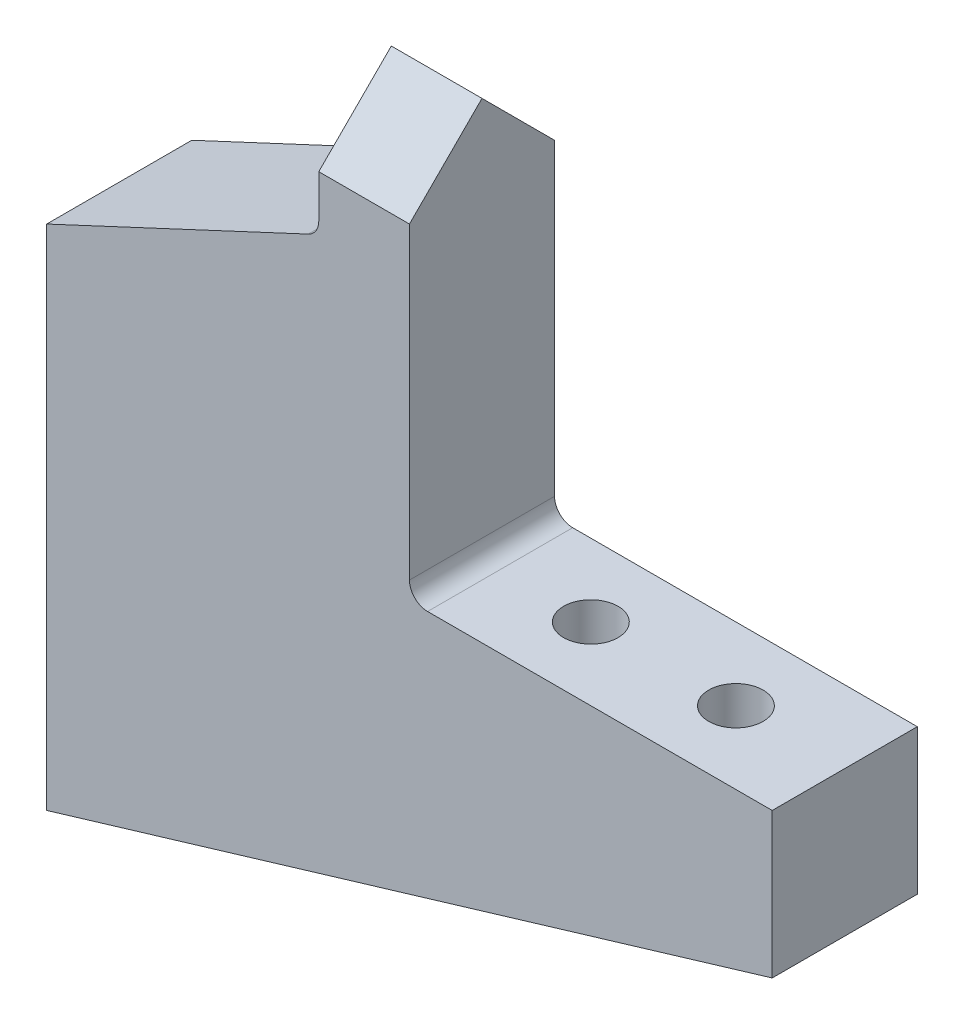
ISO-10303-21;
HEADER;
FILE_DESCRIPTION(('STEP AP214'),'2;1');
FILE_NAME('part.step','',(''),(''),'','','');
FILE_SCHEMA(('AUTOMOTIVE_DESIGN { 1 0 10303 214 1 1 1 1 }'));
ENDSEC;
DATA;
#1=APPLICATION_CONTEXT('core data for automotive mechanical design processes');
#2=APPLICATION_PROTOCOL_DEFINITION('international standard','automotive_design',2000,#1);
#3=PRODUCT_CONTEXT('',#1,'mechanical');
#4=PRODUCT('Part','Part','',(#3));
#5=PRODUCT_RELATED_PRODUCT_CATEGORY('part','',(#4));
#6=PRODUCT_DEFINITION_FORMATION('','',#4);
#7=PRODUCT_DEFINITION_CONTEXT('part definition',#1,'design');
#8=PRODUCT_DEFINITION('design','',#6,#7);
#9=PRODUCT_DEFINITION_SHAPE('','',#8);
#10=(LENGTH_UNIT() NAMED_UNIT(*) SI_UNIT(.MILLI.,.METRE.));
#11=(NAMED_UNIT(*) PLANE_ANGLE_UNIT() SI_UNIT($,.RADIAN.));
#12=(NAMED_UNIT(*) SI_UNIT($,.STERADIAN.) SOLID_ANGLE_UNIT());
#13=UNCERTAINTY_MEASURE_WITH_UNIT(LENGTH_MEASURE(1.E-05),#10,'distance_accuracy_value','');
#14=(GEOMETRIC_REPRESENTATION_CONTEXT(3) GLOBAL_UNCERTAINTY_ASSIGNED_CONTEXT((#13)) GLOBAL_UNIT_ASSIGNED_CONTEXT((#10,
#11,#12)) REPRESENTATION_CONTEXT('',''));
#15=CARTESIAN_POINT('',(0.,0.,0.));
#16=DIRECTION('',(0.,0.,1.));
#17=DIRECTION('',(1.,0.,0.));
#18=AXIS2_PLACEMENT_3D('',#15,#16,#17);
#19=CARTESIAN_POINT('',(40.,12.,8.));
#20=DIRECTION('',(-0.287347885566345,0.957826285221152,0.));
#21=DIRECTION('',(-0.957826285221152,-0.287347885566345,0.));
#22=AXIS2_PLACEMENT_3D('',#19,#20,#21);
#23=PLANE('',#22);
#24=CARTESIAN_POINT('',(34.,10.2,4.));
#25=DIRECTION('',(-0.287347885566345,0.957826285221152,0.));
#26=DIRECTION('',(0.957826285221152,0.287347885566345,0.));
#27=AXIS2_PLACEMENT_3D('',#24,#25,#26);
#28=ELLIPSE('',#27,2.61007662722764,2.5);
#29=CARTESIAN_POINT('',(36.5,10.95,4.));
#30=VERTEX_POINT('',#29);
#31=EDGE_CURVE('E194',#30,#30,#28,.T.);
#32=ORIENTED_EDGE('',*,*,#31,.T.);
#33=EDGE_LOOP('',(#32));
#34=FACE_BOUND('',#33,.T.);
#35=CARTESIAN_POINT('',(26.,7.79999999999999,4.));
#36=DIRECTION('',(-0.287347885566345,0.957826285221152,0.));
#37=DIRECTION('',(0.957826285221152,0.287347885566345,0.));
#38=AXIS2_PLACEMENT_3D('',#35,#36,#37);
#39=ELLIPSE('',#38,2.61007662722764,2.5);
#40=CARTESIAN_POINT('',(28.5,8.54999999999998,4.));
#41=VERTEX_POINT('',#40);
#42=EDGE_CURVE('E187',#41,#41,#39,.T.);
#43=ORIENTED_EDGE('',*,*,#42,.T.);
#44=EDGE_LOOP('',(#43));
#45=FACE_BOUND('',#44,.T.);
#46=DIRECTION('',(0.957826285221152,0.287347885566345,0.));
#47=VECTOR('',#46,1.);
#48=CARTESIAN_POINT('',(40.,12.,0.));
#49=LINE('',#48,#47);
#50=CARTESIAN_POINT('',(0.,0.,0.));
#51=VERTEX_POINT('',#50);
#52=CARTESIAN_POINT('',(40.,12.,0.));
#53=VERTEX_POINT('',#52);
#54=EDGE_CURVE('E213',#51,#53,#49,.T.);
#55=ORIENTED_EDGE('',*,*,#54,.T.);
#56=DIRECTION('',(0.,0.,-1.));
#57=VECTOR('',#56,1.);
#58=CARTESIAN_POINT('',(40.,12.,8.));
#59=LINE('',#58,#57);
#60=CARTESIAN_POINT('',(40.,12.,8.));
#61=VERTEX_POINT('',#60);
#62=EDGE_CURVE('E243',#61,#53,#59,.T.);
#63=ORIENTED_EDGE('',*,*,#62,.F.);
#64=DIRECTION('',(0.957826285221152,0.287347885566345,0.));
#65=VECTOR('',#64,1.);
#66=CARTESIAN_POINT('',(40.,12.,8.));
#67=LINE('',#66,#65);
#68=CARTESIAN_POINT('',(0.,0.,8.));
#69=VERTEX_POINT('',#68);
#70=EDGE_CURVE('E214',#69,#61,#67,.T.);
#71=ORIENTED_EDGE('',*,*,#70,.F.);
#72=DIRECTION('',(0.,0.,-1.));
#73=VECTOR('',#72,1.);
#74=CARTESIAN_POINT('',(0.,0.,8.));
#75=LINE('',#74,#73);
#76=EDGE_CURVE('E227',#69,#51,#75,.T.);
#77=ORIENTED_EDGE('',*,*,#76,.T.);
#78=EDGE_LOOP('',(#55,#63,#71,#77));
#79=FACE_BOUND('',#78,.T.);
#80=ADVANCED_FACE('F50',(#34,#45,#79),#23,.F.);
#81=CARTESIAN_POINT('',(40.,20.,8.));
#82=DIRECTION('',(-1.,0.,0.));
#83=DIRECTION('',(0.,0.,1.));
#84=AXIS2_PLACEMENT_3D('',#81,#82,#83);
#85=PLANE('',#84);
#86=DIRECTION('',(0.,1.,0.));
#87=VECTOR('',#86,1.);
#88=CARTESIAN_POINT('',(40.,20.,0.));
#89=LINE('',#88,#87);
#90=CARTESIAN_POINT('',(40.,20.,0.));
#91=VERTEX_POINT('',#90);
#92=EDGE_CURVE('E230',#53,#91,#89,.T.);
#93=ORIENTED_EDGE('',*,*,#92,.T.);
#94=DIRECTION('',(0.,0.,-1.));
#95=VECTOR('',#94,1.);
#96=CARTESIAN_POINT('',(40.,20.,8.));
#97=LINE('',#96,#95);
#98=CARTESIAN_POINT('',(40.,20.,8.));
#99=VERTEX_POINT('',#98);
#100=EDGE_CURVE('E240',#99,#91,#97,.T.);
#101=ORIENTED_EDGE('',*,*,#100,.F.);
#102=DIRECTION('',(0.,1.,0.));
#103=VECTOR('',#102,1.);
#104=CARTESIAN_POINT('',(40.,20.,8.));
#105=LINE('',#104,#103);
#106=EDGE_CURVE('E217',#61,#99,#105,.T.);
#107=ORIENTED_EDGE('',*,*,#106,.F.);
#108=ORIENTED_EDGE('',*,*,#62,.T.);
#109=EDGE_LOOP('',(#93,#101,#107,#108));
#110=FACE_BOUND('',#109,.T.);
#111=ADVANCED_FACE('F297',(#110),#85,.F.);
#112=CARTESIAN_POINT('',(20.,20.,8.));
#113=DIRECTION('',(0.,-1.,0.));
#114=DIRECTION('',(0.,0.,-1.));
#115=AXIS2_PLACEMENT_3D('',#112,#113,#114);
#116=PLANE('',#115);
#117=CARTESIAN_POINT('',(34.,20.,4.));
#118=DIRECTION('',(0.,1.,0.));
#119=DIRECTION('',(-1.,0.,0.));
#120=AXIS2_PLACEMENT_3D('',#117,#118,#119);
#121=CIRCLE('',#120,1.5);
#122=CARTESIAN_POINT('',(32.5,20.,4.));
#123=VERTEX_POINT('',#122);
#124=EDGE_CURVE('E195',#123,#123,#121,.T.);
#125=ORIENTED_EDGE('',*,*,#124,.F.);
#126=EDGE_LOOP('',(#125));
#127=FACE_BOUND('',#126,.T.);
#128=CARTESIAN_POINT('',(26.,20.,4.));
#129=DIRECTION('',(0.,1.,0.));
#130=DIRECTION('',(-1.,0.,0.));
#131=AXIS2_PLACEMENT_3D('',#128,#129,#130);
#132=CIRCLE('',#131,1.5);
#133=CARTESIAN_POINT('',(24.5,20.,4.));
#134=VERTEX_POINT('',#133);
#135=EDGE_CURVE('E199',#134,#134,#132,.T.);
#136=ORIENTED_EDGE('',*,*,#135,.F.);
#137=EDGE_LOOP('',(#136));
#138=FACE_BOUND('',#137,.T.);
#139=DIRECTION('',(-1.,0.,0.));
#140=VECTOR('',#139,1.);
#141=CARTESIAN_POINT('',(20.,20.,0.));
#142=LINE('',#141,#140);
#143=CARTESIAN_POINT('',(21.,20.,0.));
#144=VERTEX_POINT('',#143);
#145=EDGE_CURVE('E232',#91,#144,#142,.T.);
#146=ORIENTED_EDGE('',*,*,#145,.T.);
#147=DIRECTION('',(0.,0.,-1.));
#148=VECTOR('',#147,1.);
#149=CARTESIAN_POINT('',(21.,20.,8.));
#150=LINE('',#149,#148);
#151=CARTESIAN_POINT('',(21.,20.,8.));
#152=VERTEX_POINT('',#151);
#153=EDGE_CURVE('E256',#144,#152,#150,.F.);
#154=ORIENTED_EDGE('',*,*,#153,.T.);
#155=DIRECTION('',(-1.,0.,0.));
#156=VECTOR('',#155,1.);
#157=CARTESIAN_POINT('',(20.,20.,8.));
#158=LINE('',#157,#156);
#159=EDGE_CURVE('E220',#99,#152,#158,.T.);
#160=ORIENTED_EDGE('',*,*,#159,.F.);
#161=ORIENTED_EDGE('',*,*,#100,.T.);
#162=EDGE_LOOP('',(#146,#154,#160,#161));
#163=FACE_BOUND('',#162,.T.);
#164=ADVANCED_FACE('F303',(#127,#138,#163),#116,.F.);
#165=CARTESIAN_POINT('',(20.,42.,8.));
#166=DIRECTION('',(-1.,0.,0.));
#167=DIRECTION('',(0.,-1.,0.));
#168=AXIS2_PLACEMENT_3D('',#165,#166,#167);
#169=PLANE('',#168);
#170=DIRECTION('',(0.,1.,0.));
#171=VECTOR('',#170,1.);
#172=CARTESIAN_POINT('',(20.,42.,8.));
#173=LINE('',#172,#171);
#174=CARTESIAN_POINT('',(20.,21.,8.));
#175=VERTEX_POINT('',#174);
#176=CARTESIAN_POINT('',(20.,38.,8.));
#177=VERTEX_POINT('',#176);
#178=EDGE_CURVE('E223',#175,#177,#173,.T.);
#179=ORIENTED_EDGE('',*,*,#178,.F.);
#180=DIRECTION('',(0.,0.,-1.));
#181=VECTOR('',#180,1.);
#182=CARTESIAN_POINT('',(20.,21.,0.));
#183=LINE('',#182,#181);
#184=CARTESIAN_POINT('',(20.,21.,0.));
#185=VERTEX_POINT('',#184);
#186=EDGE_CURVE('E253',#175,#185,#183,.T.);
#187=ORIENTED_EDGE('',*,*,#186,.T.);
#188=DIRECTION('',(0.,1.,0.));
#189=VECTOR('',#188,1.);
#190=CARTESIAN_POINT('',(20.,42.,0.));
#191=LINE('',#190,#189);
#192=CARTESIAN_POINT('',(20.,38.,0.));
#193=VERTEX_POINT('',#192);
#194=EDGE_CURVE('E235',#185,#193,#191,.T.);
#195=ORIENTED_EDGE('',*,*,#194,.T.);
#196=DIRECTION('',(0.,-0.707106781186547,-0.707106781186548));
#197=VECTOR('',#196,1.);
#198=CARTESIAN_POINT('',(20.,42.,4.));
#199=LINE('',#198,#197);
#200=CARTESIAN_POINT('',(20.,42.,4.));
#201=VERTEX_POINT('',#200);
#202=EDGE_CURVE('E166',#201,#193,#199,.T.);
#203=ORIENTED_EDGE('',*,*,#202,.F.);
#204=DIRECTION('',(0.,0.707106781186548,-0.707106781186547));
#205=VECTOR('',#204,1.);
#206=CARTESIAN_POINT('',(20.,42.,4.));
#207=LINE('',#206,#205);
#208=EDGE_CURVE('E175',#177,#201,#207,.T.);
#209=ORIENTED_EDGE('',*,*,#208,.F.);
#210=EDGE_LOOP('',(#179,#187,#195,#203,#209));
#211=FACE_BOUND('',#210,.T.);
#212=ADVANCED_FACE('F281',(#211),#169,.F.);
#213=CARTESIAN_POINT('',(0.,0.,8.));
#214=DIRECTION('',(1.,0.,0.));
#215=DIRECTION('',(0.,0.,-1.));
#216=AXIS2_PLACEMENT_3D('',#213,#214,#215);
#217=PLANE('',#216);
#218=CARTESIAN_POINT('',(0.,24.,4.));
#219=DIRECTION('',(-1.,0.,0.));
#220=DIRECTION('',(0.,0.,1.));
#221=AXIS2_PLACEMENT_3D('',#218,#219,#220);
#222=CIRCLE('',#221,0.799999999999999);
#223=CARTESIAN_POINT('',(0.,24.,4.8));
#224=VERTEX_POINT('',#223);
#225=EDGE_CURVE('E150',#224,#224,#222,.T.);
#226=ORIENTED_EDGE('',*,*,#225,.F.);
#227=EDGE_LOOP('',(#226));
#228=FACE_BOUND('',#227,.T.);
#229=CARTESIAN_POINT('',(0.,16.,4.));
#230=DIRECTION('',(-1.,0.,0.));
#231=DIRECTION('',(0.,0.,1.));
#232=AXIS2_PLACEMENT_3D('',#229,#230,#231);
#233=CIRCLE('',#232,0.799999999999999);
#234=CARTESIAN_POINT('',(0.,16.,4.8));
#235=VERTEX_POINT('',#234);
#236=EDGE_CURVE('E149',#235,#235,#233,.T.);
#237=ORIENTED_EDGE('',*,*,#236,.F.);
#238=EDGE_LOOP('',(#237));
#239=FACE_BOUND('',#238,.T.);
#240=CARTESIAN_POINT('',(0.,8.,4.));
#241=DIRECTION('',(-1.,0.,0.));
#242=DIRECTION('',(0.,0.,1.));
#243=AXIS2_PLACEMENT_3D('',#240,#241,#242);
#244=CIRCLE('',#243,0.8);
#245=CARTESIAN_POINT('',(0.,8.,4.8));
#246=VERTEX_POINT('',#245);
#247=EDGE_CURVE('E160',#246,#246,#244,.T.);
#248=ORIENTED_EDGE('',*,*,#247,.F.);
#249=EDGE_LOOP('',(#248));
#250=FACE_BOUND('',#249,.T.);
#251=DIRECTION('',(0.,-1.,0.));
#252=VECTOR('',#251,1.);
#253=CARTESIAN_POINT('',(0.,0.,8.));
#254=LINE('',#253,#252);
#255=CARTESIAN_POINT('',(0.,28.,8.));
#256=VERTEX_POINT('',#255);
#257=EDGE_CURVE('E225',#256,#69,#254,.T.);
#258=ORIENTED_EDGE('',*,*,#257,.F.);
#259=DIRECTION('',(0.,0.,1.));
#260=VECTOR('',#259,1.);
#261=CARTESIAN_POINT('',(0.,28.,0.));
#262=LINE('',#261,#260);
#263=CARTESIAN_POINT('',(0.,28.,0.));
#264=VERTEX_POINT('',#263);
#265=EDGE_CURVE('E209',#264,#256,#262,.T.);
#266=ORIENTED_EDGE('',*,*,#265,.F.);
#267=DIRECTION('',(0.,-1.,0.));
#268=VECTOR('',#267,1.);
#269=CARTESIAN_POINT('',(0.,0.,0.));
#270=LINE('',#269,#268);
#271=EDGE_CURVE('E218',#264,#51,#270,.T.);
#272=ORIENTED_EDGE('',*,*,#271,.T.);
#273=ORIENTED_EDGE('',*,*,#76,.F.);
#274=EDGE_LOOP('',(#258,#266,#272,#273));
#275=FACE_BOUND('',#274,.T.);
#276=ADVANCED_FACE('F313',(#228,#239,#250,#275),#217,.F.);
#277=CARTESIAN_POINT('',(0.,0.,8.));
#278=DIRECTION('',(0.,0.,-1.));
#279=DIRECTION('',(-1.,0.,0.));
#280=AXIS2_PLACEMENT_3D('',#277,#278,#279);
#281=PLANE('',#280);
#282=ORIENTED_EDGE('',*,*,#159,.T.);
#283=CARTESIAN_POINT('',(21.,21.,8.));
#284=DIRECTION('',(0.,0.,-1.));
#285=DIRECTION('',(-1.,0.,0.));
#286=AXIS2_PLACEMENT_3D('',#283,#284,#285);
#287=CIRCLE('',#286,1.);
#288=EDGE_CURVE('E260',#152,#175,#287,.T.);
#289=ORIENTED_EDGE('',*,*,#288,.T.);
#290=ORIENTED_EDGE('',*,*,#178,.T.);
#291=DIRECTION('',(1.,0.,0.));
#292=VECTOR('',#291,1.);
#293=CARTESIAN_POINT('',(0.,38.,8.));
#294=LINE('',#293,#292);
#295=CARTESIAN_POINT('',(15.,38.,8.));
#296=VERTEX_POINT('',#295);
#297=EDGE_CURVE('E178',#296,#177,#294,.T.);
#298=ORIENTED_EDGE('',*,*,#297,.F.);
#299=DIRECTION('',(0.,1.,0.));
#300=VECTOR('',#299,1.);
#301=CARTESIAN_POINT('',(15.,42.,8.));
#302=LINE('',#301,#300);
#303=CARTESIAN_POINT('',(15.,35.6368630238165,8.));
#304=VERTEX_POINT('',#303);
#305=EDGE_CURVE('E207',#304,#296,#302,.T.);
#306=ORIENTED_EDGE('',*,*,#305,.F.);
#307=CARTESIAN_POINT('',(14.,35.6368630238165,8.));
#308=DIRECTION('',(0.,0.,-1.));
#309=DIRECTION('',(-1.,0.,0.));
#310=AXIS2_PLACEMENT_3D('',#307,#308,#309);
#311=CIRCLE('',#310,1.);
#312=CARTESIAN_POINT('',(14.4228854653311,34.7306798838212,8.));
#313=VERTEX_POINT('',#312);
#314=EDGE_CURVE('E58',#304,#313,#311,.T.);
#315=ORIENTED_EDGE('',*,*,#314,.T.);
#316=DIRECTION('',(0.906183139995265,0.422885465331124,0.));
#317=VECTOR('',#316,1.);
#318=CARTESIAN_POINT('',(15.,35.,8.));
#319=LINE('',#318,#317);
#320=EDGE_CURVE('E198',#256,#313,#319,.T.);
#321=ORIENTED_EDGE('',*,*,#320,.F.);
#322=ORIENTED_EDGE('',*,*,#257,.T.);
#323=ORIENTED_EDGE('',*,*,#70,.T.);
#324=ORIENTED_EDGE('',*,*,#106,.T.);
#325=EDGE_LOOP('',(#282,#289,#290,#298,#306,#315,#321,#322,#323,#324));
#326=FACE_BOUND('',#325,.T.);
#327=ADVANCED_FACE('F273',(#326),#281,.F.);
#328=CARTESIAN_POINT('',(0.,0.,0.));
#329=DIRECTION('',(0.,0.,-1.));
#330=DIRECTION('',(-1.,0.,0.));
#331=AXIS2_PLACEMENT_3D('',#328,#329,#330);
#332=PLANE('',#331);
#333=DIRECTION('',(1.,0.,0.));
#334=VECTOR('',#333,1.);
#335=CARTESIAN_POINT('',(0.,38.,0.));
#336=LINE('',#335,#334);
#337=CARTESIAN_POINT('',(15.,38.,0.));
#338=VERTEX_POINT('',#337);
#339=EDGE_CURVE('E169',#338,#193,#336,.T.);
#340=ORIENTED_EDGE('',*,*,#339,.T.);
#341=ORIENTED_EDGE('',*,*,#194,.F.);
#342=CARTESIAN_POINT('',(21.,21.,0.));
#343=DIRECTION('',(0.,0.,-1.));
#344=DIRECTION('',(-1.,0.,0.));
#345=AXIS2_PLACEMENT_3D('',#342,#343,#344);
#346=CIRCLE('',#345,1.);
#347=EDGE_CURVE('E258',#185,#144,#346,.F.);
#348=ORIENTED_EDGE('',*,*,#347,.T.);
#349=ORIENTED_EDGE('',*,*,#145,.F.);
#350=ORIENTED_EDGE('',*,*,#92,.F.);
#351=ORIENTED_EDGE('',*,*,#54,.F.);
#352=ORIENTED_EDGE('',*,*,#271,.F.);
#353=DIRECTION('',(0.906183139995265,0.422885465331124,0.));
#354=VECTOR('',#353,1.);
#355=CARTESIAN_POINT('',(15.,35.,0.));
#356=LINE('',#355,#354);
#357=CARTESIAN_POINT('',(14.4228854653311,34.7306798838212,0.));
#358=VERTEX_POINT('',#357);
#359=EDGE_CURVE('E204',#264,#358,#356,.T.);
#360=ORIENTED_EDGE('',*,*,#359,.T.);
#361=CARTESIAN_POINT('',(14.,35.6368630238165,0.));
#362=DIRECTION('',(0.,0.,-1.));
#363=DIRECTION('',(-1.,0.,0.));
#364=AXIS2_PLACEMENT_3D('',#361,#362,#363);
#365=CIRCLE('',#364,1.);
#366=CARTESIAN_POINT('',(15.,35.6368630238165,0.));
#367=VERTEX_POINT('',#366);
#368=EDGE_CURVE('E13',#358,#367,#365,.F.);
#369=ORIENTED_EDGE('',*,*,#368,.T.);
#370=DIRECTION('',(0.,1.,0.));
#371=VECTOR('',#370,1.);
#372=CARTESIAN_POINT('',(15.,42.,0.));
#373=LINE('',#372,#371);
#374=EDGE_CURVE('E206',#367,#338,#373,.T.);
#375=ORIENTED_EDGE('',*,*,#374,.T.);
#376=EDGE_LOOP('',(#340,#341,#348,#349,#350,#351,#352,#360,#369,#375));
#377=FACE_BOUND('',#376,.T.);
#378=ADVANCED_FACE('F288',(#377),#332,.T.);
#379=CARTESIAN_POINT('',(15.,42.,0.));
#380=DIRECTION('',(1.,0.,0.));
#381=DIRECTION('',(0.,0.,-1.));
#382=AXIS2_PLACEMENT_3D('',#379,#380,#381);
#383=PLANE('',#382);
#384=ORIENTED_EDGE('',*,*,#374,.F.);
#385=DIRECTION('',(0.,0.,1.));
#386=VECTOR('',#385,1.);
#387=CARTESIAN_POINT('',(15.,35.6368630238165,8.));
#388=LINE('',#387,#386);
#389=EDGE_CURVE('E262',#367,#304,#388,.T.);
#390=ORIENTED_EDGE('',*,*,#389,.T.);
#391=ORIENTED_EDGE('',*,*,#305,.T.);
#392=DIRECTION('',(0.,0.707106781186548,-0.707106781186547));
#393=VECTOR('',#392,1.);
#394=CARTESIAN_POINT('',(15.,44.,2.));
#395=LINE('',#394,#393);
#396=CARTESIAN_POINT('',(15.,42.,3.99999999999999));
#397=VERTEX_POINT('',#396);
#398=EDGE_CURVE('E246',#296,#397,#395,.T.);
#399=ORIENTED_EDGE('',*,*,#398,.T.);
#400=DIRECTION('',(0.,-0.707106781186547,-0.707106781186548));
#401=VECTOR('',#400,1.);
#402=CARTESIAN_POINT('',(15.,40.,2.));
#403=LINE('',#402,#401);
#404=EDGE_CURVE('E172',#397,#338,#403,.T.);
#405=ORIENTED_EDGE('',*,*,#404,.T.);
#406=EDGE_LOOP('',(#384,#390,#391,#399,#405));
#407=FACE_BOUND('',#406,.T.);
#408=ADVANCED_FACE('F268',(#407),#383,.F.);
#409=CARTESIAN_POINT('',(15.,35.,0.));
#410=DIRECTION('',(0.422885465331124,-0.906183139995266,0.));
#411=DIRECTION('',(0.906183139995266,0.422885465331124,0.));
#412=AXIS2_PLACEMENT_3D('',#409,#410,#411);
#413=PLANE('',#412);
#414=ORIENTED_EDGE('',*,*,#320,.T.);
#415=DIRECTION('',(0.,0.,1.));
#416=VECTOR('',#415,1.);
#417=CARTESIAN_POINT('',(14.4228854653311,34.7306798838212,0.));
#418=LINE('',#417,#416);
#419=EDGE_CURVE('E65',#313,#358,#418,.F.);
#420=ORIENTED_EDGE('',*,*,#419,.T.);
#421=ORIENTED_EDGE('',*,*,#359,.F.);
#422=ORIENTED_EDGE('',*,*,#265,.T.);
#423=EDGE_LOOP('',(#414,#420,#421,#422));
#424=FACE_BOUND('',#423,.T.);
#425=ADVANCED_FACE('F321',(#424),#413,.F.);
#426=CARTESIAN_POINT('',(26.,14.,4.));
#427=DIRECTION('',(0.,1.,0.));
#428=DIRECTION('',(-1.,0.,0.));
#429=AXIS2_PLACEMENT_3D('',#426,#427,#428);
#430=CYLINDRICAL_SURFACE('',#429,1.5);
#431=CARTESIAN_POINT('',(26.,14.,4.));
#432=DIRECTION('',(0.,1.,0.));
#433=DIRECTION('',(-1.,0.,0.));
#434=AXIS2_PLACEMENT_3D('',#431,#432,#433);
#435=CIRCLE('',#434,1.5);
#436=CARTESIAN_POINT('',(24.5,14.,4.));
#437=VERTEX_POINT('',#436);
#438=EDGE_CURVE('E193',#437,#437,#435,.T.);
#439=ORIENTED_EDGE('',*,*,#438,.F.);
#440=EDGE_LOOP('',(#439));
#441=FACE_BOUND('',#440,.T.);
#442=ORIENTED_EDGE('',*,*,#135,.T.);
#443=EDGE_LOOP('',(#442));
#444=FACE_BOUND('',#443,.T.);
#445=ADVANCED_FACE('F324',(#441,#444),#430,.F.);
#446=CARTESIAN_POINT('',(34.,14.,4.));
#447=DIRECTION('',(0.,1.,0.));
#448=DIRECTION('',(-1.,0.,0.));
#449=AXIS2_PLACEMENT_3D('',#446,#447,#448);
#450=CYLINDRICAL_SURFACE('',#449,1.5);
#451=CARTESIAN_POINT('',(34.,14.,4.));
#452=DIRECTION('',(0.,1.,0.));
#453=DIRECTION('',(-1.,0.,0.));
#454=AXIS2_PLACEMENT_3D('',#451,#452,#453);
#455=CIRCLE('',#454,1.5);
#456=CARTESIAN_POINT('',(32.5,14.,4.));
#457=VERTEX_POINT('',#456);
#458=EDGE_CURVE('E190',#457,#457,#455,.T.);
#459=ORIENTED_EDGE('',*,*,#458,.F.);
#460=EDGE_LOOP('',(#459));
#461=FACE_BOUND('',#460,.T.);
#462=ORIENTED_EDGE('',*,*,#124,.T.);
#463=EDGE_LOOP('',(#462));
#464=FACE_BOUND('',#463,.T.);
#465=ADVANCED_FACE('F329',(#461,#464),#450,.F.);
#466=CARTESIAN_POINT('',(26.,0.,4.));
#467=DIRECTION('',(0.,1.,0.));
#468=DIRECTION('',(-1.,0.,0.));
#469=AXIS2_PLACEMENT_3D('',#466,#467,#468);
#470=CYLINDRICAL_SURFACE('',#469,2.5);
#471=CARTESIAN_POINT('',(26.,14.,4.));
#472=DIRECTION('',(0.,1.,0.));
#473=DIRECTION('',(-1.,0.,0.));
#474=AXIS2_PLACEMENT_3D('',#471,#472,#473);
#475=CIRCLE('',#474,2.5);
#476=CARTESIAN_POINT('',(23.5,14.,4.));
#477=VERTEX_POINT('',#476);
#478=EDGE_CURVE('E181',#477,#477,#475,.T.);
#479=ORIENTED_EDGE('',*,*,#478,.T.);
#480=EDGE_LOOP('',(#479));
#481=FACE_BOUND('',#480,.T.);
#482=ORIENTED_EDGE('',*,*,#42,.F.);
#483=EDGE_LOOP('',(#482));
#484=FACE_BOUND('',#483,.T.);
#485=ADVANCED_FACE('F333',(#481,#484),#470,.F.);
#486=CARTESIAN_POINT('',(26.,14.,4.));
#487=DIRECTION('',(0.,1.,0.));
#488=DIRECTION('',(-1.,0.,0.));
#489=AXIS2_PLACEMENT_3D('',#486,#487,#488);
#490=PLANE('',#489);
#491=ORIENTED_EDGE('',*,*,#438,.T.);
#492=EDGE_LOOP('',(#491));
#493=FACE_BOUND('',#492,.T.);
#494=ORIENTED_EDGE('',*,*,#478,.F.);
#495=EDGE_LOOP('',(#494));
#496=FACE_BOUND('',#495,.T.);
#497=ADVANCED_FACE('F337',(#493,#496),#490,.F.);
#498=CARTESIAN_POINT('',(34.,0.,4.));
#499=DIRECTION('',(0.,1.,0.));
#500=DIRECTION('',(-1.,0.,0.));
#501=AXIS2_PLACEMENT_3D('',#498,#499,#500);
#502=CYLINDRICAL_SURFACE('',#501,2.5);
#503=CARTESIAN_POINT('',(34.,14.,4.));
#504=DIRECTION('',(0.,1.,0.));
#505=DIRECTION('',(-1.,0.,0.));
#506=AXIS2_PLACEMENT_3D('',#503,#504,#505);
#507=CIRCLE('',#506,2.5);
#508=CARTESIAN_POINT('',(31.5,14.,4.));
#509=VERTEX_POINT('',#508);
#510=EDGE_CURVE('E184',#509,#509,#507,.T.);
#511=ORIENTED_EDGE('',*,*,#510,.T.);
#512=EDGE_LOOP('',(#511));
#513=FACE_BOUND('',#512,.T.);
#514=ORIENTED_EDGE('',*,*,#31,.F.);
#515=EDGE_LOOP('',(#514));
#516=FACE_BOUND('',#515,.T.);
#517=ADVANCED_FACE('F341',(#513,#516),#502,.F.);
#518=CARTESIAN_POINT('',(34.,14.,4.));
#519=DIRECTION('',(0.,1.,0.));
#520=DIRECTION('',(-1.,0.,0.));
#521=AXIS2_PLACEMENT_3D('',#518,#519,#520);
#522=PLANE('',#521);
#523=ORIENTED_EDGE('',*,*,#458,.T.);
#524=EDGE_LOOP('',(#523));
#525=FACE_BOUND('',#524,.T.);
#526=ORIENTED_EDGE('',*,*,#510,.F.);
#527=EDGE_LOOP('',(#526));
#528=FACE_BOUND('',#527,.T.);
#529=ADVANCED_FACE('F345',(#525,#528),#522,.F.);
#530=CARTESIAN_POINT('',(0.,42.,4.));
#531=DIRECTION('',(0.,-0.707106781186547,-0.707106781186548));
#532=DIRECTION('',(0.,0.707106781186548,-0.707106781186547));
#533=AXIS2_PLACEMENT_3D('',#530,#531,#532);
#534=PLANE('',#533);
#535=ORIENTED_EDGE('',*,*,#297,.T.);
#536=ORIENTED_EDGE('',*,*,#208,.T.);
#537=DIRECTION('',(1.,0.,0.));
#538=VECTOR('',#537,1.);
#539=CARTESIAN_POINT('',(0.,42.,4.));
#540=LINE('',#539,#538);
#541=EDGE_CURVE('E179',#397,#201,#540,.T.);
#542=ORIENTED_EDGE('',*,*,#541,.F.);
#543=ORIENTED_EDGE('',*,*,#398,.F.);
#544=EDGE_LOOP('',(#535,#536,#542,#543));
#545=FACE_BOUND('',#544,.T.);
#546=ADVANCED_FACE('F277',(#545),#534,.F.);
#547=CARTESIAN_POINT('',(0.,42.,4.));
#548=DIRECTION('',(0.,-0.707106781186548,0.707106781186547));
#549=DIRECTION('',(0.,-0.707106781186547,-0.707106781186548));
#550=AXIS2_PLACEMENT_3D('',#547,#548,#549);
#551=PLANE('',#550);
#552=ORIENTED_EDGE('',*,*,#541,.T.);
#553=ORIENTED_EDGE('',*,*,#202,.T.);
#554=ORIENTED_EDGE('',*,*,#339,.F.);
#555=ORIENTED_EDGE('',*,*,#404,.F.);
#556=EDGE_LOOP('',(#552,#553,#554,#555));
#557=FACE_BOUND('',#556,.T.);
#558=ADVANCED_FACE('F286',(#557),#551,.F.);
#559=CARTESIAN_POINT('',(8.,8.,4.));
#560=DIRECTION('',(-1.,0.,0.));
#561=DIRECTION('',(0.,0.,1.));
#562=AXIS2_PLACEMENT_3D('',#559,#560,#561);
#563=CONICAL_SURFACE('',#562,0.799999999999999,1.02974425867665);
#564=CARTESIAN_POINT('',(8.48068849522205,8.,4.));
#565=VERTEX_POINT('',#564);
#566=VERTEX_LOOP('',#565);
#567=FACE_BOUND('',#566,.T.);
#568=CARTESIAN_POINT('',(8.,8.,4.));
#569=DIRECTION('',(-1.,0.,0.));
#570=DIRECTION('',(0.,0.,1.));
#571=AXIS2_PLACEMENT_3D('',#568,#569,#570);
#572=CIRCLE('',#571,0.799999999999999);
#573=CARTESIAN_POINT('',(8.,8.,4.8));
#574=VERTEX_POINT('',#573);
#575=EDGE_CURVE('E163',#574,#574,#572,.T.);
#576=ORIENTED_EDGE('',*,*,#575,.T.);
#577=EDGE_LOOP('',(#576));
#578=FACE_BOUND('',#577,.T.);
#579=ADVANCED_FACE('F354',(#567,#578),#563,.F.);
#580=CARTESIAN_POINT('',(0.,8.,4.));
#581=DIRECTION('',(-1.,0.,0.));
#582=DIRECTION('',(0.,0.,1.));
#583=AXIS2_PLACEMENT_3D('',#580,#581,#582);
#584=CYLINDRICAL_SURFACE('',#583,0.799999999999999);
#585=ORIENTED_EDGE('',*,*,#575,.F.);
#586=EDGE_LOOP('',(#585));
#587=FACE_BOUND('',#586,.T.);
#588=ORIENTED_EDGE('',*,*,#247,.T.);
#589=EDGE_LOOP('',(#588));
#590=FACE_BOUND('',#589,.T.);
#591=ADVANCED_FACE('F357',(#587,#590),#584,.F.);
#592=CARTESIAN_POINT('',(8.,16.,4.));
#593=DIRECTION('',(-1.,0.,0.));
#594=DIRECTION('',(0.,0.,1.));
#595=AXIS2_PLACEMENT_3D('',#592,#593,#594);
#596=CONICAL_SURFACE('',#595,0.799999999999999,1.02974425867665);
#597=CARTESIAN_POINT('',(8.48068849522205,16.,4.));
#598=VERTEX_POINT('',#597);
#599=VERTEX_LOOP('',#598);
#600=FACE_BOUND('',#599,.T.);
#601=CARTESIAN_POINT('',(8.,16.,4.));
#602=DIRECTION('',(-1.,0.,0.));
#603=DIRECTION('',(0.,0.,1.));
#604=AXIS2_PLACEMENT_3D('',#601,#602,#603);
#605=CIRCLE('',#604,0.799999999999999);
#606=CARTESIAN_POINT('',(8.,16.,4.8));
#607=VERTEX_POINT('',#606);
#608=EDGE_CURVE('E153',#607,#607,#605,.T.);
#609=ORIENTED_EDGE('',*,*,#608,.T.);
#610=EDGE_LOOP('',(#609));
#611=FACE_BOUND('',#610,.T.);
#612=ADVANCED_FACE('F361',(#600,#611),#596,.F.);
#613=CARTESIAN_POINT('',(0.,16.,4.));
#614=DIRECTION('',(-1.,0.,0.));
#615=DIRECTION('',(0.,0.,1.));
#616=AXIS2_PLACEMENT_3D('',#613,#614,#615);
#617=CYLINDRICAL_SURFACE('',#616,0.799999999999999);
#618=ORIENTED_EDGE('',*,*,#608,.F.);
#619=EDGE_LOOP('',(#618));
#620=FACE_BOUND('',#619,.T.);
#621=ORIENTED_EDGE('',*,*,#236,.T.);
#622=EDGE_LOOP('',(#621));
#623=FACE_BOUND('',#622,.T.);
#624=ADVANCED_FACE('F143',(#620,#623),#617,.F.);
#625=CARTESIAN_POINT('',(8.,24.,4.));
#626=DIRECTION('',(-1.,0.,0.));
#627=DIRECTION('',(0.,0.,1.));
#628=AXIS2_PLACEMENT_3D('',#625,#626,#627);
#629=CONICAL_SURFACE('',#628,0.799999999999999,1.02974425867665);
#630=CARTESIAN_POINT('',(8.48068849522205,24.,4.));
#631=VERTEX_POINT('',#630);
#632=VERTEX_LOOP('',#631);
#633=FACE_BOUND('',#632,.T.);
#634=CARTESIAN_POINT('',(8.,24.,4.));
#635=DIRECTION('',(-1.,0.,0.));
#636=DIRECTION('',(0.,0.,1.));
#637=AXIS2_PLACEMENT_3D('',#634,#635,#636);
#638=CIRCLE('',#637,0.799999999999999);
#639=CARTESIAN_POINT('',(8.,24.,4.8));
#640=VERTEX_POINT('',#639);
#641=EDGE_CURVE('E147',#640,#640,#638,.T.);
#642=ORIENTED_EDGE('',*,*,#641,.T.);
#643=EDGE_LOOP('',(#642));
#644=FACE_BOUND('',#643,.T.);
#645=ADVANCED_FACE('F139',(#633,#644),#629,.F.);
#646=CARTESIAN_POINT('',(0.,24.,4.));
#647=DIRECTION('',(-1.,0.,0.));
#648=DIRECTION('',(0.,0.,1.));
#649=AXIS2_PLACEMENT_3D('',#646,#647,#648);
#650=CYLINDRICAL_SURFACE('',#649,0.799999999999999);
#651=ORIENTED_EDGE('',*,*,#641,.F.);
#652=EDGE_LOOP('',(#651));
#653=FACE_BOUND('',#652,.T.);
#654=ORIENTED_EDGE('',*,*,#225,.T.);
#655=EDGE_LOOP('',(#654));
#656=FACE_BOUND('',#655,.T.);
#657=ADVANCED_FACE('F142',(#653,#656),#650,.F.);
#658=CARTESIAN_POINT('',(21.,21.,8.));
#659=DIRECTION('',(0.,0.,1.));
#660=DIRECTION('',(1.,0.,0.));
#661=AXIS2_PLACEMENT_3D('',#658,#659,#660);
#662=CYLINDRICAL_SURFACE('',#661,1.);
#663=ORIENTED_EDGE('',*,*,#288,.F.);
#664=ORIENTED_EDGE('',*,*,#153,.F.);
#665=ORIENTED_EDGE('',*,*,#347,.F.);
#666=ORIENTED_EDGE('',*,*,#186,.F.);
#667=EDGE_LOOP('',(#663,#664,#665,#666));
#668=FACE_BOUND('',#667,.T.);
#669=ADVANCED_FACE('F291',(#668),#662,.F.);
#670=CARTESIAN_POINT('',(14.,35.6368630238165,0.));
#671=DIRECTION('',(0.,0.,-1.));
#672=DIRECTION('',(-1.,0.,0.));
#673=AXIS2_PLACEMENT_3D('',#670,#671,#672);
#674=CYLINDRICAL_SURFACE('',#673,1.);
#675=ORIENTED_EDGE('',*,*,#368,.F.);
#676=ORIENTED_EDGE('',*,*,#419,.F.);
#677=ORIENTED_EDGE('',*,*,#314,.F.);
#678=ORIENTED_EDGE('',*,*,#389,.F.);
#679=EDGE_LOOP('',(#675,#676,#677,#678));
#680=FACE_BOUND('',#679,.T.);
#681=ADVANCED_FACE('F52',(#680),#674,.F.);
#682=CLOSED_SHELL('',(#80,#111,#164,#212,#276,#327,#378,#408,#425,#445,#465,#485,#497,#517,#529,
#546,#558,#579,#591,#612,#624,#645,#657,#669,#681));
#683=MANIFOLD_SOLID_BREP('B2',#682);
#684=ADVANCED_BREP_SHAPE_REPRESENTATION('',(#18,#683),#14);
#685=SHAPE_DEFINITION_REPRESENTATION(#9,#684);
ENDSEC;
END-ISO-10303-21;
